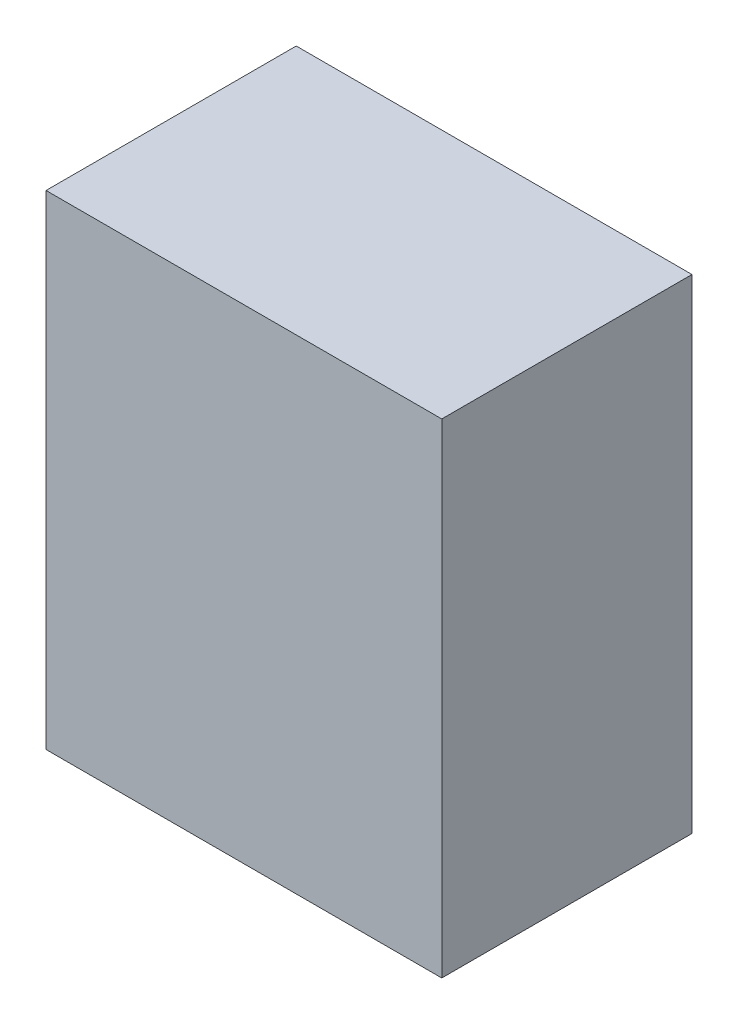
ISO-10303-21;
HEADER;
FILE_DESCRIPTION(('STEP AP214'),'2;1');
FILE_NAME('part.step','',(''),(''),'','','');
FILE_SCHEMA(('AUTOMOTIVE_DESIGN { 1 0 10303 214 1 1 1 1 }'));
ENDSEC;
DATA;
#1=APPLICATION_CONTEXT('core data for automotive mechanical design processes');
#2=APPLICATION_PROTOCOL_DEFINITION('international standard','automotive_design',2000,#1);
#3=PRODUCT_CONTEXT('',#1,'mechanical');
#4=PRODUCT('Part','Part','',(#3));
#5=PRODUCT_RELATED_PRODUCT_CATEGORY('part','',(#4));
#6=PRODUCT_DEFINITION_FORMATION('','',#4);
#7=PRODUCT_DEFINITION_CONTEXT('part definition',#1,'design');
#8=PRODUCT_DEFINITION('design','',#6,#7);
#9=PRODUCT_DEFINITION_SHAPE('','',#8);
#10=(LENGTH_UNIT() NAMED_UNIT(*) SI_UNIT(.MILLI.,.METRE.));
#11=(NAMED_UNIT(*) PLANE_ANGLE_UNIT() SI_UNIT($,.RADIAN.));
#12=(NAMED_UNIT(*) SI_UNIT($,.STERADIAN.) SOLID_ANGLE_UNIT());
#13=UNCERTAINTY_MEASURE_WITH_UNIT(LENGTH_MEASURE(1.E-05),#10,'distance_accuracy_value','');
#14=(GEOMETRIC_REPRESENTATION_CONTEXT(3) GLOBAL_UNCERTAINTY_ASSIGNED_CONTEXT((#13)) GLOBAL_UNIT_ASSIGNED_CONTEXT((#10,
#11,#12)) REPRESENTATION_CONTEXT('',''));
#15=CARTESIAN_POINT('',(0.,0.,0.));
#16=DIRECTION('',(0.,0.,1.));
#17=DIRECTION('',(1.,0.,0.));
#18=AXIS2_PLACEMENT_3D('',#15,#16,#17);
#19=CARTESIAN_POINT('',(-0.47448978,0.58050938,0.));
#20=DIRECTION('',(0.,1.,0.));
#21=DIRECTION('',(1.,0.,0.));
#22=AXIS2_PLACEMENT_3D('',#19,#20,#21);
#23=PLANE('',#22);
#24=DIRECTION('',(0.,0.,1.));
#25=VECTOR('',#24,1.);
#26=CARTESIAN_POINT('',(-0.47448978,0.58050938,0.));
#27=LINE('',#26,#25);
#28=CARTESIAN_POINT('',(-0.47448978,0.58050938,0.));
#29=VERTEX_POINT('',#28);
#30=CARTESIAN_POINT('',(-0.47448978,0.58050938,0.5999988));
#31=VERTEX_POINT('',#30);
#32=EDGE_CURVE('E11',#29,#31,#27,.T.);
#33=ORIENTED_EDGE('',*,*,#32,.T.);
#34=DIRECTION('',(1.,0.,0.));
#35=VECTOR('',#34,1.);
#36=CARTESIAN_POINT('',(-0.47448978,0.58050938,0.5999988));
#37=LINE('',#36,#35);
#38=CARTESIAN_POINT('',(0.47448978,0.58050938,0.5999988));
#39=VERTEX_POINT('',#38);
#40=EDGE_CURVE('E23',#31,#39,#37,.T.);
#41=ORIENTED_EDGE('',*,*,#40,.T.);
#42=DIRECTION('',(0.,0.,1.));
#43=VECTOR('',#42,1.);
#44=CARTESIAN_POINT('',(0.47448978,0.58050938,0.));
#45=LINE('',#44,#43);
#46=CARTESIAN_POINT('',(0.47448978,0.58050938,0.));
#47=VERTEX_POINT('',#46);
#48=EDGE_CURVE('E84',#47,#39,#45,.T.);
#49=ORIENTED_EDGE('',*,*,#48,.F.);
#50=DIRECTION('',(1.,0.,0.));
#51=VECTOR('',#50,1.);
#52=CARTESIAN_POINT('',(-0.47448978,0.58050938,0.));
#53=LINE('',#52,#51);
#54=EDGE_CURVE('E82',#29,#47,#53,.T.);
#55=ORIENTED_EDGE('',*,*,#54,.F.);
#56=EDGE_LOOP('',(#33,#41,#49,#55));
#57=FACE_BOUND('',#56,.T.);
#58=ADVANCED_FACE('F16',(#57),#23,.T.);
#59=CARTESIAN_POINT('',(0.47448978,0.58050938,0.));
#60=DIRECTION('',(1.,0.,0.));
#61=DIRECTION('',(0.,-1.,0.));
#62=AXIS2_PLACEMENT_3D('',#59,#60,#61);
#63=PLANE('',#62);
#64=ORIENTED_EDGE('',*,*,#48,.T.);
#65=DIRECTION('',(0.,-1.,0.));
#66=VECTOR('',#65,1.);
#67=CARTESIAN_POINT('',(0.47448978,0.58050938,0.5999988));
#68=LINE('',#67,#66);
#69=CARTESIAN_POINT('',(0.47448978,-0.58050938,0.5999988));
#70=VERTEX_POINT('',#69);
#71=EDGE_CURVE('E80',#39,#70,#68,.T.);
#72=ORIENTED_EDGE('',*,*,#71,.T.);
#73=DIRECTION('',(0.,0.,1.));
#74=VECTOR('',#73,1.);
#75=CARTESIAN_POINT('',(0.47448978,-0.58050938,0.));
#76=LINE('',#75,#74);
#77=CARTESIAN_POINT('',(0.47448978,-0.58050938,0.));
#78=VERTEX_POINT('',#77);
#79=EDGE_CURVE('E78',#78,#70,#76,.T.);
#80=ORIENTED_EDGE('',*,*,#79,.F.);
#81=DIRECTION('',(0.,-1.,0.));
#82=VECTOR('',#81,1.);
#83=CARTESIAN_POINT('',(0.47448978,0.58050938,0.));
#84=LINE('',#83,#82);
#85=EDGE_CURVE('E69',#47,#78,#84,.T.);
#86=ORIENTED_EDGE('',*,*,#85,.F.);
#87=EDGE_LOOP('',(#64,#72,#80,#86));
#88=FACE_BOUND('',#87,.T.);
#89=ADVANCED_FACE('F89',(#88),#63,.T.);
#90=CARTESIAN_POINT('',(0.47448978,-0.58050938,0.));
#91=DIRECTION('',(0.,-1.,0.));
#92=DIRECTION('',(-1.,0.,0.));
#93=AXIS2_PLACEMENT_3D('',#90,#91,#92);
#94=PLANE('',#93);
#95=ORIENTED_EDGE('',*,*,#79,.T.);
#96=DIRECTION('',(-1.,0.,0.));
#97=VECTOR('',#96,1.);
#98=CARTESIAN_POINT('',(0.47448978,-0.58050938,0.5999988));
#99=LINE('',#98,#97);
#100=CARTESIAN_POINT('',(-0.47448978,-0.58050938,0.5999988));
#101=VERTEX_POINT('',#100);
#102=EDGE_CURVE('E59',#70,#101,#99,.T.);
#103=ORIENTED_EDGE('',*,*,#102,.T.);
#104=DIRECTION('',(0.,0.,1.));
#105=VECTOR('',#104,1.);
#106=CARTESIAN_POINT('',(-0.47448978,-0.58050938,0.));
#107=LINE('',#106,#105);
#108=CARTESIAN_POINT('',(-0.47448978,-0.58050938,0.));
#109=VERTEX_POINT('',#108);
#110=EDGE_CURVE('E53',#109,#101,#107,.T.);
#111=ORIENTED_EDGE('',*,*,#110,.F.);
#112=DIRECTION('',(-1.,0.,0.));
#113=VECTOR('',#112,1.);
#114=CARTESIAN_POINT('',(0.47448978,-0.58050938,0.));
#115=LINE('',#114,#113);
#116=EDGE_CURVE('E57',#78,#109,#115,.T.);
#117=ORIENTED_EDGE('',*,*,#116,.F.);
#118=EDGE_LOOP('',(#95,#103,#111,#117));
#119=FACE_BOUND('',#118,.T.);
#120=ADVANCED_FACE('F56',(#119),#94,.T.);
#121=CARTESIAN_POINT('',(-0.47448978,-0.58050938,0.));
#122=DIRECTION('',(-1.,0.,0.));
#123=DIRECTION('',(0.,1.,0.));
#124=AXIS2_PLACEMENT_3D('',#121,#122,#123);
#125=PLANE('',#124);
#126=ORIENTED_EDGE('',*,*,#110,.T.);
#127=DIRECTION('',(0.,1.,0.));
#128=VECTOR('',#127,1.);
#129=CARTESIAN_POINT('',(-0.47448978,-0.58050938,0.5999988));
#130=LINE('',#129,#128);
#131=EDGE_CURVE('E70',#101,#31,#130,.T.);
#132=ORIENTED_EDGE('',*,*,#131,.T.);
#133=ORIENTED_EDGE('',*,*,#32,.F.);
#134=DIRECTION('',(0.,1.,0.));
#135=VECTOR('',#134,1.);
#136=CARTESIAN_POINT('',(-0.47448978,-0.58050938,0.));
#137=LINE('',#136,#135);
#138=EDGE_CURVE('E67',#109,#29,#137,.T.);
#139=ORIENTED_EDGE('',*,*,#138,.F.);
#140=EDGE_LOOP('',(#126,#132,#133,#139));
#141=FACE_BOUND('',#140,.T.);
#142=ADVANCED_FACE('F72',(#141),#125,.T.);
#143=CARTESIAN_POINT('',(-0.47448978,0.58050938,0.));
#144=DIRECTION('',(0.,0.,1.));
#145=DIRECTION('',(1.,0.,0.));
#146=AXIS2_PLACEMENT_3D('',#143,#144,#145);
#147=PLANE('',#146);
#148=ORIENTED_EDGE('',*,*,#54,.T.);
#149=ORIENTED_EDGE('',*,*,#85,.T.);
#150=ORIENTED_EDGE('',*,*,#116,.T.);
#151=ORIENTED_EDGE('',*,*,#138,.T.);
#152=EDGE_LOOP('',(#148,#149,#150,#151));
#153=FACE_BOUND('',#152,.T.);
#154=ADVANCED_FACE('F66',(#153),#147,.F.);
#155=CARTESIAN_POINT('',(-0.47448978,0.58050938,0.5999988));
#156=DIRECTION('',(0.,0.,1.));
#157=DIRECTION('',(1.,0.,0.));
#158=AXIS2_PLACEMENT_3D('',#155,#156,#157);
#159=PLANE('',#158);
#160=ORIENTED_EDGE('',*,*,#131,.F.);
#161=ORIENTED_EDGE('',*,*,#102,.F.);
#162=ORIENTED_EDGE('',*,*,#71,.F.);
#163=ORIENTED_EDGE('',*,*,#40,.F.);
#164=EDGE_LOOP('',(#160,#161,#162,#163));
#165=FACE_BOUND('',#164,.T.);
#166=ADVANCED_FACE('F90',(#165),#159,.T.);
#167=CLOSED_SHELL('',(#58,#89,#120,#142,#154,#166));
#168=MANIFOLD_SOLID_BREP('B1',#167);
#169=ADVANCED_BREP_SHAPE_REPRESENTATION('',(#18,#168),#14);
#170=SHAPE_DEFINITION_REPRESENTATION(#9,#169);
ENDSEC;
END-ISO-10303-21;
